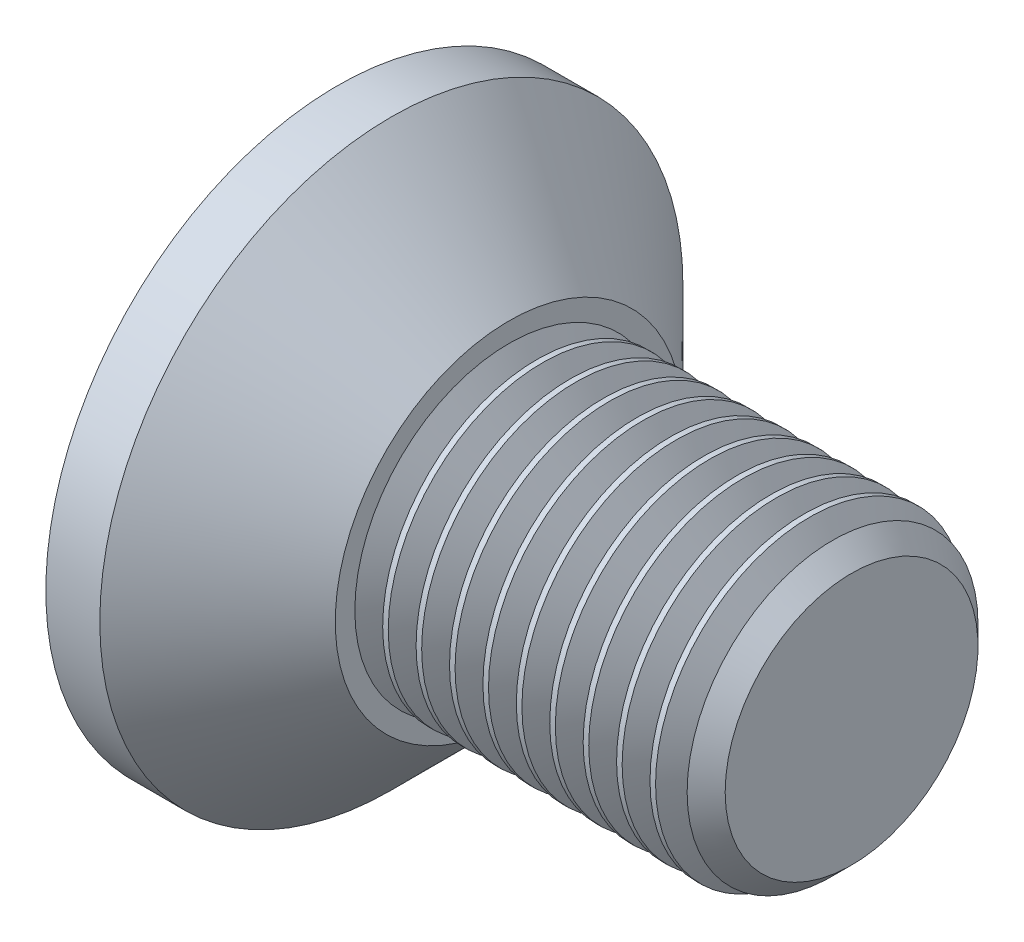
ISO-10303-21;
HEADER;
FILE_DESCRIPTION(('STEP AP214'),'2;1');
FILE_NAME('part.step','',(''),(''),'','','');
FILE_SCHEMA(('AUTOMOTIVE_DESIGN { 1 0 10303 214 1 1 1 1 }'));
ENDSEC;
DATA;
#1=APPLICATION_CONTEXT('core data for automotive mechanical design processes');
#2=APPLICATION_PROTOCOL_DEFINITION('international standard','automotive_design',2000,#1);
#3=PRODUCT_CONTEXT('',#1,'mechanical');
#4=PRODUCT('Part','Part','',(#3));
#5=PRODUCT_RELATED_PRODUCT_CATEGORY('part','',(#4));
#6=PRODUCT_DEFINITION_FORMATION('','',#4);
#7=PRODUCT_DEFINITION_CONTEXT('part definition',#1,'design');
#8=PRODUCT_DEFINITION('design','',#6,#7);
#9=PRODUCT_DEFINITION_SHAPE('','',#8);
#10=(LENGTH_UNIT() NAMED_UNIT(*) SI_UNIT(.MILLI.,.METRE.));
#11=(NAMED_UNIT(*) PLANE_ANGLE_UNIT() SI_UNIT($,.RADIAN.));
#12=(NAMED_UNIT(*) SI_UNIT($,.STERADIAN.) SOLID_ANGLE_UNIT());
#13=UNCERTAINTY_MEASURE_WITH_UNIT(LENGTH_MEASURE(1.E-05),#10,'distance_accuracy_value','');
#14=(GEOMETRIC_REPRESENTATION_CONTEXT(3) GLOBAL_UNCERTAINTY_ASSIGNED_CONTEXT((#13)) GLOBAL_UNIT_ASSIGNED_CONTEXT((#10,
#11,#12)) REPRESENTATION_CONTEXT('',''));
#15=CARTESIAN_POINT('',(0.,0.,0.));
#16=DIRECTION('',(0.,0.,1.));
#17=DIRECTION('',(1.,0.,0.));
#18=AXIS2_PLACEMENT_3D('',#15,#16,#17);
#19=CARTESIAN_POINT('',(-0.587069180985524,0.,0.));
#20=DIRECTION('',(-1.,0.,0.));
#21=DIRECTION('',(0.,0.,1.));
#22=AXIS2_PLACEMENT_3D('',#19,#20,#21);
#23=CYLINDRICAL_SURFACE('',#22,3.);
#24=CARTESIAN_POINT('',(3.98935,0.,0.));
#25=DIRECTION('',(-1.,0.,0.));
#26=DIRECTION('',(0.,0.,1.));
#27=AXIS2_PLACEMENT_3D('',#24,#25,#26);
#28=CIRCLE('',#27,3.);
#29=CARTESIAN_POINT('',(3.98935,0.,3.));
#30=VERTEX_POINT('',#29);
#31=EDGE_CURVE('E626',#30,#30,#28,.T.);
#32=ORIENTED_EDGE('',*,*,#31,.T.);
#33=EDGE_LOOP('',(#32));
#34=FACE_BOUND('',#33,.T.);
#35=CARTESIAN_POINT('',(3.88105,0.,0.));
#36=DIRECTION('',(-1.,0.,0.));
#37=DIRECTION('',(0.,0.,1.));
#38=AXIS2_PLACEMENT_3D('',#35,#36,#37);
#39=CIRCLE('',#38,3.);
#40=CARTESIAN_POINT('',(3.88105,0.,3.));
#41=VERTEX_POINT('',#40);
#42=EDGE_CURVE('E620',#41,#41,#39,.T.);
#43=ORIENTED_EDGE('',*,*,#42,.F.);
#44=EDGE_LOOP('',(#43));
#45=FACE_BOUND('',#44,.T.);
#46=ADVANCED_FACE('F31',(#34,#45),#23,.T.);
#47=CARTESIAN_POINT('',(4.63915,0.,0.));
#48=DIRECTION('',(-1.,0.,0.));
#49=DIRECTION('',(0.,0.,1.));
#50=AXIS2_PLACEMENT_3D('',#47,#48,#49);
#51=CIRCLE('',#50,3.);
#52=CARTESIAN_POINT('',(4.63915,0.,3.));
#53=VERTEX_POINT('',#52);
#54=EDGE_CURVE('E634',#53,#53,#51,.T.);
#55=ORIENTED_EDGE('',*,*,#54,.T.);
#56=EDGE_LOOP('',(#55));
#57=FACE_BOUND('',#56,.T.);
#58=CARTESIAN_POINT('',(4.53085,0.,0.));
#59=DIRECTION('',(-1.,0.,0.));
#60=DIRECTION('',(0.,0.,1.));
#61=AXIS2_PLACEMENT_3D('',#58,#59,#60);
#62=CIRCLE('',#61,3.);
#63=CARTESIAN_POINT('',(4.53085,0.,3.));
#64=VERTEX_POINT('',#63);
#65=EDGE_CURVE('E628',#64,#64,#62,.T.);
#66=ORIENTED_EDGE('',*,*,#65,.F.);
#67=EDGE_LOOP('',(#66));
#68=FACE_BOUND('',#67,.T.);
#69=ADVANCED_FACE('F126',(#57,#68),#23,.T.);
#70=CARTESIAN_POINT('',(5.28895,0.,0.));
#71=DIRECTION('',(-1.,0.,0.));
#72=DIRECTION('',(0.,0.,1.));
#73=AXIS2_PLACEMENT_3D('',#70,#71,#72);
#74=CIRCLE('',#73,3.);
#75=CARTESIAN_POINT('',(5.28895,0.,3.));
#76=VERTEX_POINT('',#75);
#77=EDGE_CURVE('E643',#76,#76,#74,.T.);
#78=ORIENTED_EDGE('',*,*,#77,.T.);
#79=EDGE_LOOP('',(#78));
#80=FACE_BOUND('',#79,.T.);
#81=CARTESIAN_POINT('',(5.18065,0.,0.));
#82=DIRECTION('',(-1.,0.,0.));
#83=DIRECTION('',(0.,0.,1.));
#84=AXIS2_PLACEMENT_3D('',#81,#82,#83);
#85=CIRCLE('',#84,3.);
#86=CARTESIAN_POINT('',(5.18065,0.,3.));
#87=VERTEX_POINT('',#86);
#88=EDGE_CURVE('E637',#87,#87,#85,.T.);
#89=ORIENTED_EDGE('',*,*,#88,.F.);
#90=EDGE_LOOP('',(#89));
#91=FACE_BOUND('',#90,.T.);
#92=ADVANCED_FACE('F134',(#80,#91),#23,.T.);
#93=CARTESIAN_POINT('',(5.93875000000001,0.,0.));
#94=DIRECTION('',(-1.,0.,0.));
#95=DIRECTION('',(0.,0.,1.));
#96=AXIS2_PLACEMENT_3D('',#93,#94,#95);
#97=CIRCLE('',#96,3.);
#98=CARTESIAN_POINT('',(5.93875000000001,0.,3.));
#99=VERTEX_POINT('',#98);
#100=EDGE_CURVE('E652',#99,#99,#97,.T.);
#101=ORIENTED_EDGE('',*,*,#100,.T.);
#102=EDGE_LOOP('',(#101));
#103=FACE_BOUND('',#102,.T.);
#104=CARTESIAN_POINT('',(5.83045,0.,0.));
#105=DIRECTION('',(-1.,0.,0.));
#106=DIRECTION('',(0.,0.,1.));
#107=AXIS2_PLACEMENT_3D('',#104,#105,#106);
#108=CIRCLE('',#107,3.);
#109=CARTESIAN_POINT('',(5.83045,0.,3.));
#110=VERTEX_POINT('',#109);
#111=EDGE_CURVE('E646',#110,#110,#108,.T.);
#112=ORIENTED_EDGE('',*,*,#111,.F.);
#113=EDGE_LOOP('',(#112));
#114=FACE_BOUND('',#113,.T.);
#115=ADVANCED_FACE('F402',(#103,#114),#23,.T.);
#116=CARTESIAN_POINT('',(6.58855000000001,0.,0.));
#117=DIRECTION('',(-1.,0.,0.));
#118=DIRECTION('',(0.,0.,1.));
#119=AXIS2_PLACEMENT_3D('',#116,#117,#118);
#120=CIRCLE('',#119,3.);
#121=CARTESIAN_POINT('',(6.58855000000001,0.,3.));
#122=VERTEX_POINT('',#121);
#123=EDGE_CURVE('E661',#122,#122,#120,.T.);
#124=ORIENTED_EDGE('',*,*,#123,.T.);
#125=EDGE_LOOP('',(#124));
#126=FACE_BOUND('',#125,.T.);
#127=CARTESIAN_POINT('',(6.48025000000001,0.,0.));
#128=DIRECTION('',(-1.,0.,0.));
#129=DIRECTION('',(0.,0.,1.));
#130=AXIS2_PLACEMENT_3D('',#127,#128,#129);
#131=CIRCLE('',#130,3.);
#132=CARTESIAN_POINT('',(6.48025000000001,0.,3.));
#133=VERTEX_POINT('',#132);
#134=EDGE_CURVE('E655',#133,#133,#131,.T.);
#135=ORIENTED_EDGE('',*,*,#134,.F.);
#136=EDGE_LOOP('',(#135));
#137=FACE_BOUND('',#136,.T.);
#138=ADVANCED_FACE('F394',(#126,#137),#23,.T.);
#139=CARTESIAN_POINT('',(7.23835,0.,0.));
#140=DIRECTION('',(-1.,0.,0.));
#141=DIRECTION('',(0.,0.,1.));
#142=AXIS2_PLACEMENT_3D('',#139,#140,#141);
#143=CIRCLE('',#142,3.);
#144=CARTESIAN_POINT('',(7.23835,0.,3.));
#145=VERTEX_POINT('',#144);
#146=EDGE_CURVE('E670',#145,#145,#143,.T.);
#147=ORIENTED_EDGE('',*,*,#146,.T.);
#148=EDGE_LOOP('',(#147));
#149=FACE_BOUND('',#148,.T.);
#150=CARTESIAN_POINT('',(7.13005000000001,0.,0.));
#151=DIRECTION('',(-1.,0.,0.));
#152=DIRECTION('',(0.,0.,1.));
#153=AXIS2_PLACEMENT_3D('',#150,#151,#152);
#154=CIRCLE('',#153,3.);
#155=CARTESIAN_POINT('',(7.13005000000001,0.,3.));
#156=VERTEX_POINT('',#155);
#157=EDGE_CURVE('E664',#156,#156,#154,.T.);
#158=ORIENTED_EDGE('',*,*,#157,.F.);
#159=EDGE_LOOP('',(#158));
#160=FACE_BOUND('',#159,.T.);
#161=ADVANCED_FACE('F170',(#149,#160),#23,.T.);
#162=CARTESIAN_POINT('',(7.88815,0.,0.));
#163=DIRECTION('',(-1.,0.,0.));
#164=DIRECTION('',(0.,0.,1.));
#165=AXIS2_PLACEMENT_3D('',#162,#163,#164);
#166=CIRCLE('',#165,3.);
#167=CARTESIAN_POINT('',(7.88815,0.,3.));
#168=VERTEX_POINT('',#167);
#169=EDGE_CURVE('E181',#168,#168,#166,.T.);
#170=ORIENTED_EDGE('',*,*,#169,.T.);
#171=EDGE_LOOP('',(#170));
#172=FACE_BOUND('',#171,.T.);
#173=CARTESIAN_POINT('',(7.77985000000001,0.,0.));
#174=DIRECTION('',(-1.,0.,0.));
#175=DIRECTION('',(0.,0.,1.));
#176=AXIS2_PLACEMENT_3D('',#173,#174,#175);
#177=CIRCLE('',#176,3.);
#178=CARTESIAN_POINT('',(7.77985000000001,0.,3.));
#179=VERTEX_POINT('',#178);
#180=EDGE_CURVE('E673',#179,#179,#177,.T.);
#181=ORIENTED_EDGE('',*,*,#180,.F.);
#182=EDGE_LOOP('',(#181));
#183=FACE_BOUND('',#182,.T.);
#184=ADVANCED_FACE('F160',(#172,#183),#23,.T.);
#185=CARTESIAN_POINT('',(8.53795,0.,0.));
#186=DIRECTION('',(-1.,0.,0.));
#187=DIRECTION('',(0.,0.,1.));
#188=AXIS2_PLACEMENT_3D('',#185,#186,#187);
#189=CIRCLE('',#188,3.);
#190=CARTESIAN_POINT('',(8.53795,0.,3.));
#191=VERTEX_POINT('',#190);
#192=EDGE_CURVE('E175',#191,#191,#189,.T.);
#193=ORIENTED_EDGE('',*,*,#192,.T.);
#194=EDGE_LOOP('',(#193));
#195=FACE_BOUND('',#194,.T.);
#196=CARTESIAN_POINT('',(8.42965000000001,0.,0.));
#197=DIRECTION('',(-1.,0.,0.));
#198=DIRECTION('',(0.,0.,1.));
#199=AXIS2_PLACEMENT_3D('',#196,#197,#198);
#200=CIRCLE('',#199,3.);
#201=CARTESIAN_POINT('',(8.42965000000001,0.,3.));
#202=VERTEX_POINT('',#201);
#203=EDGE_CURVE('E178',#202,#202,#200,.T.);
#204=ORIENTED_EDGE('',*,*,#203,.F.);
#205=EDGE_LOOP('',(#204));
#206=FACE_BOUND('',#205,.T.);
#207=ADVANCED_FACE('F143',(#195,#206),#23,.T.);
#208=CARTESIAN_POINT('',(8.53795,0.,0.));
#209=DIRECTION('',(-1.,0.,0.));
#210=DIRECTION('',(0.,0.,1.));
#211=AXIS2_PLACEMENT_3D('',#208,#209,#210);
#212=CONICAL_SURFACE('',#211,3.,1.0471975511966);
#213=CARTESIAN_POINT('',(8.8087,0.,0.));
#214=DIRECTION('',(-1.,0.,0.));
#215=DIRECTION('',(0.,0.,1.));
#216=AXIS2_PLACEMENT_3D('',#213,#214,#215);
#217=CIRCLE('',#216,2.53104724385073);
#218=CARTESIAN_POINT('',(8.8087,0.,2.53104724385073));
#219=VERTEX_POINT('',#218);
#220=EDGE_CURVE('E194',#219,#219,#217,.T.);
#221=ORIENTED_EDGE('',*,*,#220,.T.);
#222=EDGE_LOOP('',(#221));
#223=FACE_BOUND('',#222,.T.);
#224=ORIENTED_EDGE('',*,*,#192,.F.);
#225=EDGE_LOOP('',(#224));
#226=FACE_BOUND('',#225,.T.);
#227=ADVANCED_FACE('F159',(#223,#226),#212,.T.);
#228=CARTESIAN_POINT('',(8.8087,0.,0.));
#229=DIRECTION('',(1.,0.,0.));
#230=DIRECTION('',(0.,0.,-1.));
#231=AXIS2_PLACEMENT_3D('',#228,#229,#230);
#232=CONICAL_SURFACE('',#231,2.53104724385073,1.0471975511966);
#233=CARTESIAN_POINT('',(9.07945,0.,0.));
#234=DIRECTION('',(-1.,0.,0.));
#235=DIRECTION('',(0.,0.,1.));
#236=AXIS2_PLACEMENT_3D('',#233,#234,#235);
#237=CIRCLE('',#236,3.);
#238=CARTESIAN_POINT('',(9.07945,0.,3.));
#239=VERTEX_POINT('',#238);
#240=EDGE_CURVE('E191',#239,#239,#237,.T.);
#241=ORIENTED_EDGE('',*,*,#240,.T.);
#242=EDGE_LOOP('',(#241));
#243=FACE_BOUND('',#242,.T.);
#244=ORIENTED_EDGE('',*,*,#220,.F.);
#245=EDGE_LOOP('',(#244));
#246=FACE_BOUND('',#245,.T.);
#247=ADVANCED_FACE('F167',(#243,#246),#232,.T.);
#248=CARTESIAN_POINT('',(10.,3.,0.));
#249=DIRECTION('',(-1.,0.,0.));
#250=DIRECTION('',(0.,0.,1.));
#251=AXIS2_PLACEMENT_3D('',#248,#249,#250);
#252=PLANE('',#251);
#253=CARTESIAN_POINT('',(10.,0.,0.));
#254=DIRECTION('',(-1.,0.,0.));
#255=DIRECTION('',(0.,0.,1.));
#256=AXIS2_PLACEMENT_3D('',#253,#254,#255);
#257=CIRCLE('',#256,2.4585);
#258=CARTESIAN_POINT('',(10.,0.,2.4585));
#259=VERTEX_POINT('',#258);
#260=EDGE_CURVE('E11',#259,#259,#257,.F.);
#261=ORIENTED_EDGE('',*,*,#260,.T.);
#262=EDGE_LOOP('',(#261));
#263=FACE_BOUND('',#262,.T.);
#264=ADVANCED_FACE('F276',(#263),#252,.F.);
#265=CARTESIAN_POINT('',(9.4585,0.,0.));
#266=DIRECTION('',(-1.,0.,0.));
#267=DIRECTION('',(0.,0.,1.));
#268=AXIS2_PLACEMENT_3D('',#265,#266,#267);
#269=CONICAL_SURFACE('',#268,3.,0.78539816339745);
#270=ORIENTED_EDGE('',*,*,#260,.F.);
#271=EDGE_LOOP('',(#270));
#272=FACE_BOUND('',#271,.T.);
#273=CARTESIAN_POINT('',(9.63014862192537,0.,0.));
#274=DIRECTION('',(1.,0.,0.));
#275=DIRECTION('',(0.,0.,-1.));
#276=AXIS2_PLACEMENT_3D('',#273,#274,#275);
#277=CIRCLE('',#276,2.82835137807464);
#278=CARTESIAN_POINT('',(9.63014862192537,0.,-2.82835137807464));
#279=VERTEX_POINT('',#278);
#280=EDGE_CURVE('E202',#279,#279,#277,.T.);
#281=ORIENTED_EDGE('',*,*,#280,.T.);
#282=EDGE_LOOP('',(#281));
#283=FACE_BOUND('',#282,.T.);
#284=ADVANCED_FACE('F33',(#272,#283),#269,.T.);
#285=CARTESIAN_POINT('',(9.4585,0.,0.));
#286=DIRECTION('',(1.,0.,0.));
#287=DIRECTION('',(0.,0.,-1.));
#288=AXIS2_PLACEMENT_3D('',#285,#286,#287);
#289=CONICAL_SURFACE('',#288,2.53104724385073,1.0471975511966);
#290=ORIENTED_EDGE('',*,*,#280,.F.);
#291=EDGE_LOOP('',(#290));
#292=FACE_BOUND('',#291,.T.);
#293=CARTESIAN_POINT('',(9.4585,0.,0.));
#294=DIRECTION('',(-1.,0.,0.));
#295=DIRECTION('',(0.,0.,1.));
#296=AXIS2_PLACEMENT_3D('',#293,#294,#295);
#297=CIRCLE('',#296,2.53104724385073);
#298=CARTESIAN_POINT('',(9.4585,0.,2.53104724385073));
#299=VERTEX_POINT('',#298);
#300=EDGE_CURVE('E199',#299,#299,#297,.T.);
#301=ORIENTED_EDGE('',*,*,#300,.F.);
#302=EDGE_LOOP('',(#301));
#303=FACE_BOUND('',#302,.T.);
#304=ADVANCED_FACE('F153',(#292,#303),#289,.T.);
#305=CARTESIAN_POINT('',(9.18775,0.,0.));
#306=DIRECTION('',(-1.,0.,0.));
#307=DIRECTION('',(0.,0.,1.));
#308=AXIS2_PLACEMENT_3D('',#305,#306,#307);
#309=CONICAL_SURFACE('',#308,3.,1.0471975511966);
#310=ORIENTED_EDGE('',*,*,#300,.T.);
#311=EDGE_LOOP('',(#310));
#312=FACE_BOUND('',#311,.T.);
#313=CARTESIAN_POINT('',(9.18775,0.,0.));
#314=DIRECTION('',(-1.,0.,0.));
#315=DIRECTION('',(0.,0.,1.));
#316=AXIS2_PLACEMENT_3D('',#313,#314,#315);
#317=CIRCLE('',#316,3.);
#318=CARTESIAN_POINT('',(9.18775,0.,3.));
#319=VERTEX_POINT('',#318);
#320=EDGE_CURVE('E197',#319,#319,#317,.T.);
#321=ORIENTED_EDGE('',*,*,#320,.F.);
#322=EDGE_LOOP('',(#321));
#323=FACE_BOUND('',#322,.T.);
#324=ADVANCED_FACE('F141',(#312,#323),#309,.T.);
#325=ORIENTED_EDGE('',*,*,#320,.T.);
#326=EDGE_LOOP('',(#325));
#327=FACE_BOUND('',#326,.T.);
#328=ORIENTED_EDGE('',*,*,#240,.F.);
#329=EDGE_LOOP('',(#328));
#330=FACE_BOUND('',#329,.T.);
#331=ADVANCED_FACE('F129',(#327,#330),#23,.T.);
#332=CARTESIAN_POINT('',(7.88815,0.,0.));
#333=DIRECTION('',(-1.,0.,0.));
#334=DIRECTION('',(0.,0.,1.));
#335=AXIS2_PLACEMENT_3D('',#332,#333,#334);
#336=CONICAL_SURFACE('',#335,3.,1.0471975511966);
#337=CARTESIAN_POINT('',(8.15890000000001,0.,0.));
#338=DIRECTION('',(-1.,0.,0.));
#339=DIRECTION('',(0.,0.,1.));
#340=AXIS2_PLACEMENT_3D('',#337,#338,#339);
#341=CIRCLE('',#340,2.53104724385073);
#342=CARTESIAN_POINT('',(8.15890000000001,0.,2.53104724385073));
#343=VERTEX_POINT('',#342);
#344=EDGE_CURVE('E180',#343,#343,#341,.T.);
#345=ORIENTED_EDGE('',*,*,#344,.T.);
#346=EDGE_LOOP('',(#345));
#347=FACE_BOUND('',#346,.T.);
#348=ORIENTED_EDGE('',*,*,#169,.F.);
#349=EDGE_LOOP('',(#348));
#350=FACE_BOUND('',#349,.T.);
#351=ADVANCED_FACE('F140',(#347,#350),#336,.T.);
#352=CARTESIAN_POINT('',(8.15890000000001,0.,0.));
#353=DIRECTION('',(1.,0.,0.));
#354=DIRECTION('',(0.,0.,-1.));
#355=AXIS2_PLACEMENT_3D('',#352,#353,#354);
#356=CONICAL_SURFACE('',#355,2.53104724385073,1.0471975511966);
#357=ORIENTED_EDGE('',*,*,#203,.T.);
#358=EDGE_LOOP('',(#357));
#359=FACE_BOUND('',#358,.T.);
#360=ORIENTED_EDGE('',*,*,#344,.F.);
#361=EDGE_LOOP('',(#360));
#362=FACE_BOUND('',#361,.T.);
#363=ADVANCED_FACE('F149',(#359,#362),#356,.T.);
#364=CARTESIAN_POINT('',(7.23835,0.,0.));
#365=DIRECTION('',(-1.,0.,0.));
#366=DIRECTION('',(0.,0.,1.));
#367=AXIS2_PLACEMENT_3D('',#364,#365,#366);
#368=CONICAL_SURFACE('',#367,3.,1.0471975511966);
#369=CARTESIAN_POINT('',(7.5091,0.,0.));
#370=DIRECTION('',(-1.,0.,0.));
#371=DIRECTION('',(0.,0.,1.));
#372=AXIS2_PLACEMENT_3D('',#369,#370,#371);
#373=CIRCLE('',#372,2.53104724385073);
#374=CARTESIAN_POINT('',(7.5091,0.,2.53104724385073));
#375=VERTEX_POINT('',#374);
#376=EDGE_CURVE('E186',#375,#375,#373,.T.);
#377=ORIENTED_EDGE('',*,*,#376,.T.);
#378=EDGE_LOOP('',(#377));
#379=FACE_BOUND('',#378,.T.);
#380=ORIENTED_EDGE('',*,*,#146,.F.);
#381=EDGE_LOOP('',(#380));
#382=FACE_BOUND('',#381,.T.);
#383=ADVANCED_FACE('F456',(#379,#382),#368,.T.);
#384=CARTESIAN_POINT('',(7.5091,0.,0.));
#385=DIRECTION('',(1.,0.,0.));
#386=DIRECTION('',(0.,0.,-1.));
#387=AXIS2_PLACEMENT_3D('',#384,#385,#386);
#388=CONICAL_SURFACE('',#387,2.53104724385073,1.0471975511966);
#389=ORIENTED_EDGE('',*,*,#180,.T.);
#390=EDGE_LOOP('',(#389));
#391=FACE_BOUND('',#390,.T.);
#392=ORIENTED_EDGE('',*,*,#376,.F.);
#393=EDGE_LOOP('',(#392));
#394=FACE_BOUND('',#393,.T.);
#395=ADVANCED_FACE('F464',(#391,#394),#388,.T.);
#396=CARTESIAN_POINT('',(6.58855000000001,0.,0.));
#397=DIRECTION('',(-1.,0.,0.));
#398=DIRECTION('',(0.,0.,1.));
#399=AXIS2_PLACEMENT_3D('',#396,#397,#398);
#400=CONICAL_SURFACE('',#399,3.,1.0471975511966);
#401=CARTESIAN_POINT('',(6.8593,0.,0.));
#402=DIRECTION('',(-1.,0.,0.));
#403=DIRECTION('',(0.,0.,1.));
#404=AXIS2_PLACEMENT_3D('',#401,#402,#403);
#405=CIRCLE('',#404,2.53104724385073);
#406=CARTESIAN_POINT('',(6.8593,0.,2.53104724385073));
#407=VERTEX_POINT('',#406);
#408=EDGE_CURVE('E667',#407,#407,#405,.T.);
#409=ORIENTED_EDGE('',*,*,#408,.T.);
#410=EDGE_LOOP('',(#409));
#411=FACE_BOUND('',#410,.T.);
#412=ORIENTED_EDGE('',*,*,#123,.F.);
#413=EDGE_LOOP('',(#412));
#414=FACE_BOUND('',#413,.T.);
#415=ADVANCED_FACE('F473',(#411,#414),#400,.T.);
#416=CARTESIAN_POINT('',(6.8593,0.,0.));
#417=DIRECTION('',(1.,0.,0.));
#418=DIRECTION('',(0.,0.,-1.));
#419=AXIS2_PLACEMENT_3D('',#416,#417,#418);
#420=CONICAL_SURFACE('',#419,2.53104724385073,1.0471975511966);
#421=ORIENTED_EDGE('',*,*,#157,.T.);
#422=EDGE_LOOP('',(#421));
#423=FACE_BOUND('',#422,.T.);
#424=ORIENTED_EDGE('',*,*,#408,.F.);
#425=EDGE_LOOP('',(#424));
#426=FACE_BOUND('',#425,.T.);
#427=ADVANCED_FACE('F482',(#423,#426),#420,.T.);
#428=CARTESIAN_POINT('',(5.93875000000001,0.,0.));
#429=DIRECTION('',(-1.,0.,0.));
#430=DIRECTION('',(0.,0.,1.));
#431=AXIS2_PLACEMENT_3D('',#428,#429,#430);
#432=CONICAL_SURFACE('',#431,3.,1.0471975511966);
#433=CARTESIAN_POINT('',(6.2095,0.,0.));
#434=DIRECTION('',(-1.,0.,0.));
#435=DIRECTION('',(0.,0.,1.));
#436=AXIS2_PLACEMENT_3D('',#433,#434,#435);
#437=CIRCLE('',#436,2.53104724385073);
#438=CARTESIAN_POINT('',(6.2095,0.,2.53104724385073));
#439=VERTEX_POINT('',#438);
#440=EDGE_CURVE('E658',#439,#439,#437,.T.);
#441=ORIENTED_EDGE('',*,*,#440,.T.);
#442=EDGE_LOOP('',(#441));
#443=FACE_BOUND('',#442,.T.);
#444=ORIENTED_EDGE('',*,*,#100,.F.);
#445=EDGE_LOOP('',(#444));
#446=FACE_BOUND('',#445,.T.);
#447=ADVANCED_FACE('F491',(#443,#446),#432,.T.);
#448=CARTESIAN_POINT('',(6.2095,0.,0.));
#449=DIRECTION('',(1.,0.,0.));
#450=DIRECTION('',(0.,0.,-1.));
#451=AXIS2_PLACEMENT_3D('',#448,#449,#450);
#452=CONICAL_SURFACE('',#451,2.53104724385073,1.0471975511966);
#453=ORIENTED_EDGE('',*,*,#134,.T.);
#454=EDGE_LOOP('',(#453));
#455=FACE_BOUND('',#454,.T.);
#456=ORIENTED_EDGE('',*,*,#440,.F.);
#457=EDGE_LOOP('',(#456));
#458=FACE_BOUND('',#457,.T.);
#459=ADVANCED_FACE('F500',(#455,#458),#452,.T.);
#460=CARTESIAN_POINT('',(5.28895,0.,0.));
#461=DIRECTION('',(-1.,0.,0.));
#462=DIRECTION('',(0.,0.,1.));
#463=AXIS2_PLACEMENT_3D('',#460,#461,#462);
#464=CONICAL_SURFACE('',#463,3.,1.0471975511966);
#465=CARTESIAN_POINT('',(5.5597,0.,0.));
#466=DIRECTION('',(-1.,0.,0.));
#467=DIRECTION('',(0.,0.,1.));
#468=AXIS2_PLACEMENT_3D('',#465,#466,#467);
#469=CIRCLE('',#468,2.53104724385073);
#470=CARTESIAN_POINT('',(5.5597,0.,2.53104724385073));
#471=VERTEX_POINT('',#470);
#472=EDGE_CURVE('E649',#471,#471,#469,.T.);
#473=ORIENTED_EDGE('',*,*,#472,.T.);
#474=EDGE_LOOP('',(#473));
#475=FACE_BOUND('',#474,.T.);
#476=ORIENTED_EDGE('',*,*,#77,.F.);
#477=EDGE_LOOP('',(#476));
#478=FACE_BOUND('',#477,.T.);
#479=ADVANCED_FACE('F509',(#475,#478),#464,.T.);
#480=CARTESIAN_POINT('',(5.5597,0.,0.));
#481=DIRECTION('',(1.,0.,0.));
#482=DIRECTION('',(0.,0.,-1.));
#483=AXIS2_PLACEMENT_3D('',#480,#481,#482);
#484=CONICAL_SURFACE('',#483,2.53104724385073,1.0471975511966);
#485=ORIENTED_EDGE('',*,*,#111,.T.);
#486=EDGE_LOOP('',(#485));
#487=FACE_BOUND('',#486,.T.);
#488=ORIENTED_EDGE('',*,*,#472,.F.);
#489=EDGE_LOOP('',(#488));
#490=FACE_BOUND('',#489,.T.);
#491=ADVANCED_FACE('F518',(#487,#490),#484,.T.);
#492=CARTESIAN_POINT('',(4.63915,0.,0.));
#493=DIRECTION('',(-1.,0.,0.));
#494=DIRECTION('',(0.,0.,1.));
#495=AXIS2_PLACEMENT_3D('',#492,#493,#494);
#496=CONICAL_SURFACE('',#495,3.,1.0471975511966);
#497=CARTESIAN_POINT('',(4.9099,0.,0.));
#498=DIRECTION('',(-1.,0.,0.));
#499=DIRECTION('',(0.,0.,1.));
#500=AXIS2_PLACEMENT_3D('',#497,#498,#499);
#501=CIRCLE('',#500,2.53104724385073);
#502=CARTESIAN_POINT('',(4.9099,0.,2.53104724385073));
#503=VERTEX_POINT('',#502);
#504=EDGE_CURVE('E640',#503,#503,#501,.T.);
#505=ORIENTED_EDGE('',*,*,#504,.T.);
#506=EDGE_LOOP('',(#505));
#507=FACE_BOUND('',#506,.T.);
#508=ORIENTED_EDGE('',*,*,#54,.F.);
#509=EDGE_LOOP('',(#508));
#510=FACE_BOUND('',#509,.T.);
#511=ADVANCED_FACE('F527',(#507,#510),#496,.T.);
#512=CARTESIAN_POINT('',(4.9099,0.,0.));
#513=DIRECTION('',(1.,0.,0.));
#514=DIRECTION('',(0.,0.,-1.));
#515=AXIS2_PLACEMENT_3D('',#512,#513,#514);
#516=CONICAL_SURFACE('',#515,2.53104724385073,1.0471975511966);
#517=ORIENTED_EDGE('',*,*,#88,.T.);
#518=EDGE_LOOP('',(#517));
#519=FACE_BOUND('',#518,.T.);
#520=ORIENTED_EDGE('',*,*,#504,.F.);
#521=EDGE_LOOP('',(#520));
#522=FACE_BOUND('',#521,.T.);
#523=ADVANCED_FACE('F536',(#519,#522),#516,.T.);
#524=CARTESIAN_POINT('',(3.98935,0.,0.));
#525=DIRECTION('',(-1.,0.,0.));
#526=DIRECTION('',(0.,0.,1.));
#527=AXIS2_PLACEMENT_3D('',#524,#525,#526);
#528=CONICAL_SURFACE('',#527,3.,1.0471975511966);
#529=CARTESIAN_POINT('',(4.2601,0.,0.));
#530=DIRECTION('',(-1.,0.,0.));
#531=DIRECTION('',(0.,0.,1.));
#532=AXIS2_PLACEMENT_3D('',#529,#530,#531);
#533=CIRCLE('',#532,2.53104724385073);
#534=CARTESIAN_POINT('',(4.2601,0.,2.53104724385073));
#535=VERTEX_POINT('',#534);
#536=EDGE_CURVE('E631',#535,#535,#533,.T.);
#537=ORIENTED_EDGE('',*,*,#536,.T.);
#538=EDGE_LOOP('',(#537));
#539=FACE_BOUND('',#538,.T.);
#540=ORIENTED_EDGE('',*,*,#31,.F.);
#541=EDGE_LOOP('',(#540));
#542=FACE_BOUND('',#541,.T.);
#543=ADVANCED_FACE('F545',(#539,#542),#528,.T.);
#544=CARTESIAN_POINT('',(4.2601,0.,0.));
#545=DIRECTION('',(1.,0.,0.));
#546=DIRECTION('',(0.,0.,-1.));
#547=AXIS2_PLACEMENT_3D('',#544,#545,#546);
#548=CONICAL_SURFACE('',#547,2.53104724385073,1.0471975511966);
#549=ORIENTED_EDGE('',*,*,#65,.T.);
#550=EDGE_LOOP('',(#549));
#551=FACE_BOUND('',#550,.T.);
#552=ORIENTED_EDGE('',*,*,#536,.F.);
#553=EDGE_LOOP('',(#552));
#554=FACE_BOUND('',#553,.T.);
#555=ADVANCED_FACE('F554',(#551,#554),#548,.T.);
#556=CARTESIAN_POINT('',(3.33955,3.5415,0.));
#557=DIRECTION('',(1.,0.,0.));
#558=DIRECTION('',(0.,0.,-1.));
#559=AXIS2_PLACEMENT_3D('',#556,#557,#558);
#560=PLANE('',#559);
#561=CARTESIAN_POINT('',(3.33955,0.,0.));
#562=DIRECTION('',(-1.,0.,0.));
#563=DIRECTION('',(0.,0.,1.));
#564=AXIS2_PLACEMENT_3D('',#561,#562,#563);
#565=CIRCLE('',#564,3.);
#566=CARTESIAN_POINT('',(3.33955,0.,3.));
#567=VERTEX_POINT('',#566);
#568=EDGE_CURVE('E619',#567,#567,#565,.T.);
#569=ORIENTED_EDGE('',*,*,#568,.T.);
#570=EDGE_LOOP('',(#569));
#571=FACE_BOUND('',#570,.T.);
#572=CARTESIAN_POINT('',(3.33955,0.,0.));
#573=DIRECTION('',(1.,0.,0.));
#574=DIRECTION('',(0.,0.,-1.));
#575=AXIS2_PLACEMENT_3D('',#572,#573,#574);
#576=CIRCLE('',#575,3.38044999999999);
#577=CARTESIAN_POINT('',(3.33955,0.,-3.38044999999999));
#578=VERTEX_POINT('',#577);
#579=EDGE_CURVE('E35',#578,#578,#576,.T.);
#580=ORIENTED_EDGE('',*,*,#579,.T.);
#581=EDGE_LOOP('',(#580));
#582=FACE_BOUND('',#581,.T.);
#583=ADVANCED_FACE('F563',(#571,#582),#560,.T.);
#584=CARTESIAN_POINT('',(3.33955,0.,0.));
#585=DIRECTION('',(-1.,0.,0.));
#586=DIRECTION('',(0.,0.,1.));
#587=AXIS2_PLACEMENT_3D('',#584,#585,#586);
#588=CONICAL_SURFACE('',#587,3.,1.0471975511966);
#589=CARTESIAN_POINT('',(3.6103,0.,0.));
#590=DIRECTION('',(-1.,0.,0.));
#591=DIRECTION('',(0.,0.,1.));
#592=AXIS2_PLACEMENT_3D('',#589,#590,#591);
#593=CIRCLE('',#592,2.53104724385073);
#594=CARTESIAN_POINT('',(3.6103,0.,2.53104724385073));
#595=VERTEX_POINT('',#594);
#596=EDGE_CURVE('E616',#595,#595,#593,.T.);
#597=ORIENTED_EDGE('',*,*,#596,.T.);
#598=EDGE_LOOP('',(#597));
#599=FACE_BOUND('',#598,.T.);
#600=ORIENTED_EDGE('',*,*,#568,.F.);
#601=EDGE_LOOP('',(#600));
#602=FACE_BOUND('',#601,.T.);
#603=ADVANCED_FACE('F121',(#599,#602),#588,.T.);
#604=CARTESIAN_POINT('',(3.6103,0.,0.));
#605=DIRECTION('',(1.,0.,0.));
#606=DIRECTION('',(0.,0.,-1.));
#607=AXIS2_PLACEMENT_3D('',#604,#605,#606);
#608=CONICAL_SURFACE('',#607,2.53104724385073,1.0471975511966);
#609=ORIENTED_EDGE('',*,*,#42,.T.);
#610=EDGE_LOOP('',(#609));
#611=FACE_BOUND('',#610,.T.);
#612=ORIENTED_EDGE('',*,*,#596,.F.);
#613=EDGE_LOOP('',(#612));
#614=FACE_BOUND('',#613,.T.);
#615=ADVANCED_FACE('F110',(#611,#614),#608,.T.);
#616=CARTESIAN_POINT('',(3.35470053837925,0.,0.));
#617=DIRECTION('',(-1.,0.,0.));
#618=DIRECTION('',(0.,0.,1.));
#619=AXIS2_PLACEMENT_3D('',#616,#617,#618);
#620=CONICAL_SURFACE('',#619,0.,1.0471975511966);
#621=CARTESIAN_POINT('',(2.2,0.,0.));
#622=DIRECTION('',(-1.,0.,0.));
#623=DIRECTION('',(0.,0.,1.));
#624=AXIS2_PLACEMENT_3D('',#621,#622,#623);
#625=CIRCLE('',#624,2.);
#626=CARTESIAN_POINT('',(2.2,1.,1.73205080756888));
#627=VERTEX_POINT('',#626);
#628=CARTESIAN_POINT('',(2.2,2.,0.));
#629=VERTEX_POINT('',#628);
#630=EDGE_CURVE('E206',#627,#629,#625,.T.);
#631=ORIENTED_EDGE('',*,*,#630,.T.);
#632=CARTESIAN_POINT('',(2.2,1.,-1.73205080756888));
#633=VERTEX_POINT('',#632);
#634=EDGE_CURVE('E40',#629,#633,#625,.T.);
#635=ORIENTED_EDGE('',*,*,#634,.T.);
#636=CARTESIAN_POINT('',(2.2,-1.,-1.73205080756888));
#637=VERTEX_POINT('',#636);
#638=EDGE_CURVE('E308',#633,#637,#625,.T.);
#639=ORIENTED_EDGE('',*,*,#638,.T.);
#640=CARTESIAN_POINT('',(2.2,-2.,0.));
#641=VERTEX_POINT('',#640);
#642=EDGE_CURVE('E306',#637,#641,#625,.T.);
#643=ORIENTED_EDGE('',*,*,#642,.T.);
#644=CARTESIAN_POINT('',(2.2,-1.,1.73205080756888));
#645=VERTEX_POINT('',#644);
#646=EDGE_CURVE('E48',#641,#645,#625,.T.);
#647=ORIENTED_EDGE('',*,*,#646,.T.);
#648=EDGE_CURVE('E209',#645,#627,#625,.T.);
#649=ORIENTED_EDGE('',*,*,#648,.T.);
#650=EDGE_LOOP('',(#631,#635,#639,#643,#647,#649));
#651=FACE_BOUND('',#650,.T.);
#652=CARTESIAN_POINT('',(3.35470053837925,0.,0.));
#653=VERTEX_POINT('',#652);
#654=VERTEX_LOOP('',#653);
#655=FACE_BOUND('',#654,.T.);
#656=ADVANCED_FACE('F107',(#651,#655),#620,.F.);
#657=CARTESIAN_POINT('',(2.2,0.,-2.3094010767585));
#658=DIRECTION('',(1.,0.,0.));
#659=DIRECTION('',(0.,0.,-1.));
#660=AXIS2_PLACEMENT_3D('',#657,#658,#659);
#661=PLANE('',#660);
#662=ORIENTED_EDGE('',*,*,#646,.F.);
#663=DIRECTION('',(0.,0.,-1.));
#664=VECTOR('',#663,1.);
#665=CARTESIAN_POINT('',(2.2,-2.,1.15470053837925));
#666=LINE('',#665,#664);
#667=CARTESIAN_POINT('',(2.2,-2.,1.15470053837925));
#668=VERTEX_POINT('',#667);
#669=EDGE_CURVE('E231',#668,#641,#666,.T.);
#670=ORIENTED_EDGE('',*,*,#669,.F.);
#671=DIRECTION('',(0.,-0.866025403784439,-0.5));
#672=VECTOR('',#671,1.);
#673=CARTESIAN_POINT('',(2.2,0.,2.3094010767585));
#674=LINE('',#673,#672);
#675=EDGE_CURVE('E226',#645,#668,#674,.T.);
#676=ORIENTED_EDGE('',*,*,#675,.F.);
#677=EDGE_LOOP('',(#662,#670,#676));
#678=FACE_BOUND('',#677,.T.);
#679=ADVANCED_FACE('F109',(#678),#661,.F.);
#680=ORIENTED_EDGE('',*,*,#648,.F.);
#681=CARTESIAN_POINT('',(2.2,0.,2.3094010767585));
#682=VERTEX_POINT('',#681);
#683=EDGE_CURVE('E227',#682,#645,#674,.T.);
#684=ORIENTED_EDGE('',*,*,#683,.F.);
#685=DIRECTION('',(0.,-0.866025403784438,0.5));
#686=VECTOR('',#685,1.);
#687=CARTESIAN_POINT('',(2.2,2.,1.15470053837925));
#688=LINE('',#687,#686);
#689=EDGE_CURVE('E222',#627,#682,#688,.T.);
#690=ORIENTED_EDGE('',*,*,#689,.F.);
#691=EDGE_LOOP('',(#680,#684,#690));
#692=FACE_BOUND('',#691,.T.);
#693=ADVANCED_FACE('F116',(#692),#661,.F.);
#694=ORIENTED_EDGE('',*,*,#630,.F.);
#695=CARTESIAN_POINT('',(2.2,2.,1.15470053837925));
#696=VERTEX_POINT('',#695);
#697=EDGE_CURVE('E223',#696,#627,#688,.T.);
#698=ORIENTED_EDGE('',*,*,#697,.F.);
#699=DIRECTION('',(0.,0.,1.));
#700=VECTOR('',#699,1.);
#701=CARTESIAN_POINT('',(2.2,2.,-1.15470053837925));
#702=LINE('',#701,#700);
#703=EDGE_CURVE('E218',#629,#696,#702,.T.);
#704=ORIENTED_EDGE('',*,*,#703,.F.);
#705=EDGE_LOOP('',(#694,#698,#704));
#706=FACE_BOUND('',#705,.T.);
#707=ADVANCED_FACE('F338',(#706),#661,.F.);
#708=ORIENTED_EDGE('',*,*,#634,.F.);
#709=CARTESIAN_POINT('',(2.2,2.,-1.15470053837925));
#710=VERTEX_POINT('',#709);
#711=EDGE_CURVE('E219',#710,#629,#702,.T.);
#712=ORIENTED_EDGE('',*,*,#711,.F.);
#713=DIRECTION('',(0.,0.866025403784438,0.5));
#714=VECTOR('',#713,1.);
#715=CARTESIAN_POINT('',(2.2,0.,-2.3094010767585));
#716=LINE('',#715,#714);
#717=EDGE_CURVE('E213',#633,#710,#716,.T.);
#718=ORIENTED_EDGE('',*,*,#717,.F.);
#719=EDGE_LOOP('',(#708,#712,#718));
#720=FACE_BOUND('',#719,.T.);
#721=ADVANCED_FACE('F343',(#720),#661,.F.);
#722=ORIENTED_EDGE('',*,*,#638,.F.);
#723=CARTESIAN_POINT('',(2.2,0.,-2.3094010767585));
#724=VERTEX_POINT('',#723);
#725=EDGE_CURVE('E215',#724,#633,#716,.T.);
#726=ORIENTED_EDGE('',*,*,#725,.F.);
#727=DIRECTION('',(0.,0.866025403784439,-0.5));
#728=VECTOR('',#727,1.);
#729=CARTESIAN_POINT('',(2.2,-2.,-1.15470053837925));
#730=LINE('',#729,#728);
#731=EDGE_CURVE('E214',#637,#724,#730,.T.);
#732=ORIENTED_EDGE('',*,*,#731,.F.);
#733=EDGE_LOOP('',(#722,#726,#732));
#734=FACE_BOUND('',#733,.T.);
#735=ADVANCED_FACE('F312',(#734),#661,.F.);
#736=ORIENTED_EDGE('',*,*,#642,.F.);
#737=CARTESIAN_POINT('',(2.2,-2.,-1.15470053837925));
#738=VERTEX_POINT('',#737);
#739=EDGE_CURVE('E210',#738,#637,#730,.T.);
#740=ORIENTED_EDGE('',*,*,#739,.F.);
#741=EDGE_CURVE('E230',#641,#738,#666,.T.);
#742=ORIENTED_EDGE('',*,*,#741,.F.);
#743=EDGE_LOOP('',(#736,#740,#742));
#744=FACE_BOUND('',#743,.T.);
#745=ADVANCED_FACE('F119',(#744),#661,.F.);
#746=CARTESIAN_POINT('',(2.2,-2.,1.15470053837925));
#747=DIRECTION('',(0.,1.,0.));
#748=DIRECTION('',(0.,0.,1.));
#749=AXIS2_PLACEMENT_3D('',#746,#747,#748);
#750=PLANE('',#749);
#751=DIRECTION('',(0.,0.,-1.));
#752=VECTOR('',#751,1.);
#753=CARTESIAN_POINT('',(0.,-2.,1.15470053837925));
#754=LINE('',#753,#752);
#755=CARTESIAN_POINT('',(0.,-2.,1.15470053837925));
#756=VERTEX_POINT('',#755);
#757=CARTESIAN_POINT('',(0.,-2.,-1.15470053837925));
#758=VERTEX_POINT('',#757);
#759=EDGE_CURVE('E248',#756,#758,#754,.T.);
#760=ORIENTED_EDGE('',*,*,#759,.F.);
#761=DIRECTION('',(-1.,0.,0.));
#762=VECTOR('',#761,1.);
#763=CARTESIAN_POINT('',(2.2,-2.,1.15470053837925));
#764=LINE('',#763,#762);
#765=EDGE_CURVE('E252',#668,#756,#764,.T.);
#766=ORIENTED_EDGE('',*,*,#765,.F.);
#767=ORIENTED_EDGE('',*,*,#669,.T.);
#768=ORIENTED_EDGE('',*,*,#741,.T.);
#769=DIRECTION('',(-1.,0.,0.));
#770=VECTOR('',#769,1.);
#771=CARTESIAN_POINT('',(2.2,-2.,-1.15470053837925));
#772=LINE('',#771,#770);
#773=EDGE_CURVE('E234',#738,#758,#772,.T.);
#774=ORIENTED_EDGE('',*,*,#773,.T.);
#775=EDGE_LOOP('',(#760,#766,#767,#768,#774));
#776=FACE_BOUND('',#775,.T.);
#777=ADVANCED_FACE('F300',(#776),#750,.T.);
#778=CARTESIAN_POINT('',(2.2,0.,2.3094010767585));
#779=DIRECTION('',(0.,0.5,-0.866025403784438));
#780=DIRECTION('',(0.,0.866025403784439,0.5));
#781=AXIS2_PLACEMENT_3D('',#778,#779,#780);
#782=PLANE('',#781);
#783=DIRECTION('',(0.,-0.866025403784439,-0.5));
#784=VECTOR('',#783,1.);
#785=CARTESIAN_POINT('',(0.,0.,2.3094010767585));
#786=LINE('',#785,#784);
#787=CARTESIAN_POINT('',(0.,0.,2.3094010767585));
#788=VERTEX_POINT('',#787);
#789=EDGE_CURVE('E245',#788,#756,#786,.T.);
#790=ORIENTED_EDGE('',*,*,#789,.F.);
#791=DIRECTION('',(-1.,0.,0.));
#792=VECTOR('',#791,1.);
#793=CARTESIAN_POINT('',(2.2,0.,2.3094010767585));
#794=LINE('',#793,#792);
#795=EDGE_CURVE('E254',#682,#788,#794,.T.);
#796=ORIENTED_EDGE('',*,*,#795,.F.);
#797=ORIENTED_EDGE('',*,*,#683,.T.);
#798=ORIENTED_EDGE('',*,*,#675,.T.);
#799=ORIENTED_EDGE('',*,*,#765,.T.);
#800=EDGE_LOOP('',(#790,#796,#797,#798,#799));
#801=FACE_BOUND('',#800,.T.);
#802=ADVANCED_FACE('F331',(#801),#782,.T.);
#803=CARTESIAN_POINT('',(2.2,2.,1.15470053837925));
#804=DIRECTION('',(0.,-0.5,-0.866025403784439));
#805=DIRECTION('',(0.,0.866025403784438,-0.5));
#806=AXIS2_PLACEMENT_3D('',#803,#804,#805);
#807=PLANE('',#806);
#808=DIRECTION('',(0.,-0.866025403784438,0.5));
#809=VECTOR('',#808,1.);
#810=CARTESIAN_POINT('',(0.,2.,1.15470053837925));
#811=LINE('',#810,#809);
#812=CARTESIAN_POINT('',(0.,2.,1.15470053837925));
#813=VERTEX_POINT('',#812);
#814=EDGE_CURVE('E242',#813,#788,#811,.T.);
#815=ORIENTED_EDGE('',*,*,#814,.F.);
#816=DIRECTION('',(-1.,0.,0.));
#817=VECTOR('',#816,1.);
#818=CARTESIAN_POINT('',(2.2,2.,1.15470053837925));
#819=LINE('',#818,#817);
#820=EDGE_CURVE('E256',#696,#813,#819,.T.);
#821=ORIENTED_EDGE('',*,*,#820,.F.);
#822=ORIENTED_EDGE('',*,*,#697,.T.);
#823=ORIENTED_EDGE('',*,*,#689,.T.);
#824=ORIENTED_EDGE('',*,*,#795,.T.);
#825=EDGE_LOOP('',(#815,#821,#822,#823,#824));
#826=FACE_BOUND('',#825,.T.);
#827=ADVANCED_FACE('F325',(#826),#807,.T.);
#828=CARTESIAN_POINT('',(2.2,2.,-1.15470053837925));
#829=DIRECTION('',(0.,-1.,0.));
#830=DIRECTION('',(0.,0.,-1.));
#831=AXIS2_PLACEMENT_3D('',#828,#829,#830);
#832=PLANE('',#831);
#833=DIRECTION('',(0.,0.,1.));
#834=VECTOR('',#833,1.);
#835=CARTESIAN_POINT('',(0.,2.,-1.15470053837925));
#836=LINE('',#835,#834);
#837=CARTESIAN_POINT('',(0.,2.,-1.15470053837925));
#838=VERTEX_POINT('',#837);
#839=EDGE_CURVE('E239',#838,#813,#836,.T.);
#840=ORIENTED_EDGE('',*,*,#839,.F.);
#841=DIRECTION('',(-1.,0.,0.));
#842=VECTOR('',#841,1.);
#843=CARTESIAN_POINT('',(2.2,2.,-1.15470053837925));
#844=LINE('',#843,#842);
#845=EDGE_CURVE('E258',#710,#838,#844,.T.);
#846=ORIENTED_EDGE('',*,*,#845,.F.);
#847=ORIENTED_EDGE('',*,*,#711,.T.);
#848=ORIENTED_EDGE('',*,*,#703,.T.);
#849=ORIENTED_EDGE('',*,*,#820,.T.);
#850=EDGE_LOOP('',(#840,#846,#847,#848,#849));
#851=FACE_BOUND('',#850,.T.);
#852=ADVANCED_FACE('F321',(#851),#832,.T.);
#853=CARTESIAN_POINT('',(2.2,0.,-2.3094010767585));
#854=DIRECTION('',(0.,-0.5,0.866025403784438));
#855=DIRECTION('',(0.,-0.866025403784438,-0.5));
#856=AXIS2_PLACEMENT_3D('',#853,#854,#855);
#857=PLANE('',#856);
#858=DIRECTION('',(0.,0.866025403784438,0.5));
#859=VECTOR('',#858,1.);
#860=CARTESIAN_POINT('',(0.,0.,-2.3094010767585));
#861=LINE('',#860,#859);
#862=CARTESIAN_POINT('',(0.,0.,-2.3094010767585));
#863=VERTEX_POINT('',#862);
#864=EDGE_CURVE('E236',#863,#838,#861,.T.);
#865=ORIENTED_EDGE('',*,*,#864,.F.);
#866=DIRECTION('',(-1.,0.,0.));
#867=VECTOR('',#866,1.);
#868=CARTESIAN_POINT('',(2.2,0.,-2.3094010767585));
#869=LINE('',#868,#867);
#870=EDGE_CURVE('E260',#724,#863,#869,.T.);
#871=ORIENTED_EDGE('',*,*,#870,.F.);
#872=ORIENTED_EDGE('',*,*,#725,.T.);
#873=ORIENTED_EDGE('',*,*,#717,.T.);
#874=ORIENTED_EDGE('',*,*,#845,.T.);
#875=EDGE_LOOP('',(#865,#871,#872,#873,#874));
#876=FACE_BOUND('',#875,.T.);
#877=ADVANCED_FACE('F316',(#876),#857,.T.);
#878=CARTESIAN_POINT('',(2.2,-2.,-1.15470053837925));
#879=DIRECTION('',(0.,0.5,0.866025403784439));
#880=DIRECTION('',(0.,-0.866025403784439,0.5));
#881=AXIS2_PLACEMENT_3D('',#878,#879,#880);
#882=PLANE('',#881);
#883=DIRECTION('',(0.,0.866025403784439,-0.5));
#884=VECTOR('',#883,1.);
#885=CARTESIAN_POINT('',(0.,-2.,-1.15470053837925));
#886=LINE('',#885,#884);
#887=EDGE_CURVE('E56',#758,#863,#886,.T.);
#888=ORIENTED_EDGE('',*,*,#887,.F.);
#889=ORIENTED_EDGE('',*,*,#773,.F.);
#890=ORIENTED_EDGE('',*,*,#739,.T.);
#891=ORIENTED_EDGE('',*,*,#731,.T.);
#892=ORIENTED_EDGE('',*,*,#870,.T.);
#893=EDGE_LOOP('',(#888,#889,#890,#891,#892));
#894=FACE_BOUND('',#893,.T.);
#895=ADVANCED_FACE('F289',(#894),#882,.T.);
#896=CARTESIAN_POINT('',(0.,0.,0.));
#897=DIRECTION('',(1.,0.,0.));
#898=DIRECTION('',(0.,0.,-1.));
#899=AXIS2_PLACEMENT_3D('',#896,#897,#898);
#900=PLANE('',#899);
#901=CARTESIAN_POINT('',(0.,0.,0.));
#902=DIRECTION('',(1.,0.,0.));
#903=DIRECTION('',(0.,0.,-1.));
#904=AXIS2_PLACEMENT_3D('',#901,#902,#903);
#905=CIRCLE('',#904,5.67);
#906=CARTESIAN_POINT('',(0.,0.,-5.67));
#907=VERTEX_POINT('',#906);
#908=EDGE_CURVE('E203',#907,#907,#905,.F.);
#909=ORIENTED_EDGE('',*,*,#908,.T.);
#910=EDGE_LOOP('',(#909));
#911=FACE_BOUND('',#910,.T.);
#912=ORIENTED_EDGE('',*,*,#887,.T.);
#913=ORIENTED_EDGE('',*,*,#864,.T.);
#914=ORIENTED_EDGE('',*,*,#839,.T.);
#915=ORIENTED_EDGE('',*,*,#814,.T.);
#916=ORIENTED_EDGE('',*,*,#789,.T.);
#917=ORIENTED_EDGE('',*,*,#759,.T.);
#918=EDGE_LOOP('',(#912,#913,#914,#915,#916,#917));
#919=FACE_BOUND('',#918,.T.);
#920=ADVANCED_FACE('F281',(#911,#919),#900,.F.);
#921=CARTESIAN_POINT('',(11.8531386861314,0.,0.));
#922=DIRECTION('',(1.,0.,0.));
#923=DIRECTION('',(0.,0.,-1.));
#924=AXIS2_PLACEMENT_3D('',#921,#922,#923);
#925=CYLINDRICAL_SURFACE('',#924,5.67);
#926=CARTESIAN_POINT('',(1.05,0.,0.));
#927=DIRECTION('',(-1.,0.,0.));
#928=DIRECTION('',(0.,0.,1.));
#929=AXIS2_PLACEMENT_3D('',#926,#927,#928);
#930=CIRCLE('',#929,5.67);
#931=CARTESIAN_POINT('',(1.05,0.,5.67));
#932=VERTEX_POINT('',#931);
#933=EDGE_CURVE('E207',#932,#932,#930,.F.);
#934=ORIENTED_EDGE('',*,*,#933,.F.);
#935=EDGE_LOOP('',(#934));
#936=FACE_BOUND('',#935,.T.);
#937=ORIENTED_EDGE('',*,*,#908,.F.);
#938=EDGE_LOOP('',(#937));
#939=FACE_BOUND('',#938,.T.);
#940=ADVANCED_FACE('F279',(#936,#939),#925,.T.);
#941=CARTESIAN_POINT('',(3.72,0.,0.));
#942=DIRECTION('',(-1.,0.,0.));
#943=DIRECTION('',(0.,0.,1.));
#944=AXIS2_PLACEMENT_3D('',#941,#942,#943);
#945=CONICAL_SURFACE('',#944,3.,0.785398163397448);
#946=ORIENTED_EDGE('',*,*,#933,.T.);
#947=EDGE_LOOP('',(#946));
#948=FACE_BOUND('',#947,.T.);
#949=ORIENTED_EDGE('',*,*,#579,.F.);
#950=EDGE_LOOP('',(#949));
#951=FACE_BOUND('',#950,.T.);
#952=ADVANCED_FACE('F280',(#948,#951),#945,.T.);
#953=CLOSED_SHELL('',(#46,#69,#92,#115,#138,#161,#184,#207,#227,#247,#264,#284,#304,#324,#331,
#351,#363,#383,#395,#415,#427,#447,#459,#479,#491,#511,#523,#543,#555,#583,#603,#615,#656,#679,
#693,#707,#721,#735,#745,#777,#802,#827,#852,#877,#895,#920,#940,#952));
#954=MANIFOLD_SOLID_BREP('B2',#953);
#955=ADVANCED_BREP_SHAPE_REPRESENTATION('',(#18,#954),#14);
#956=SHAPE_DEFINITION_REPRESENTATION(#9,#955);
ENDSEC;
END-ISO-10303-21;
